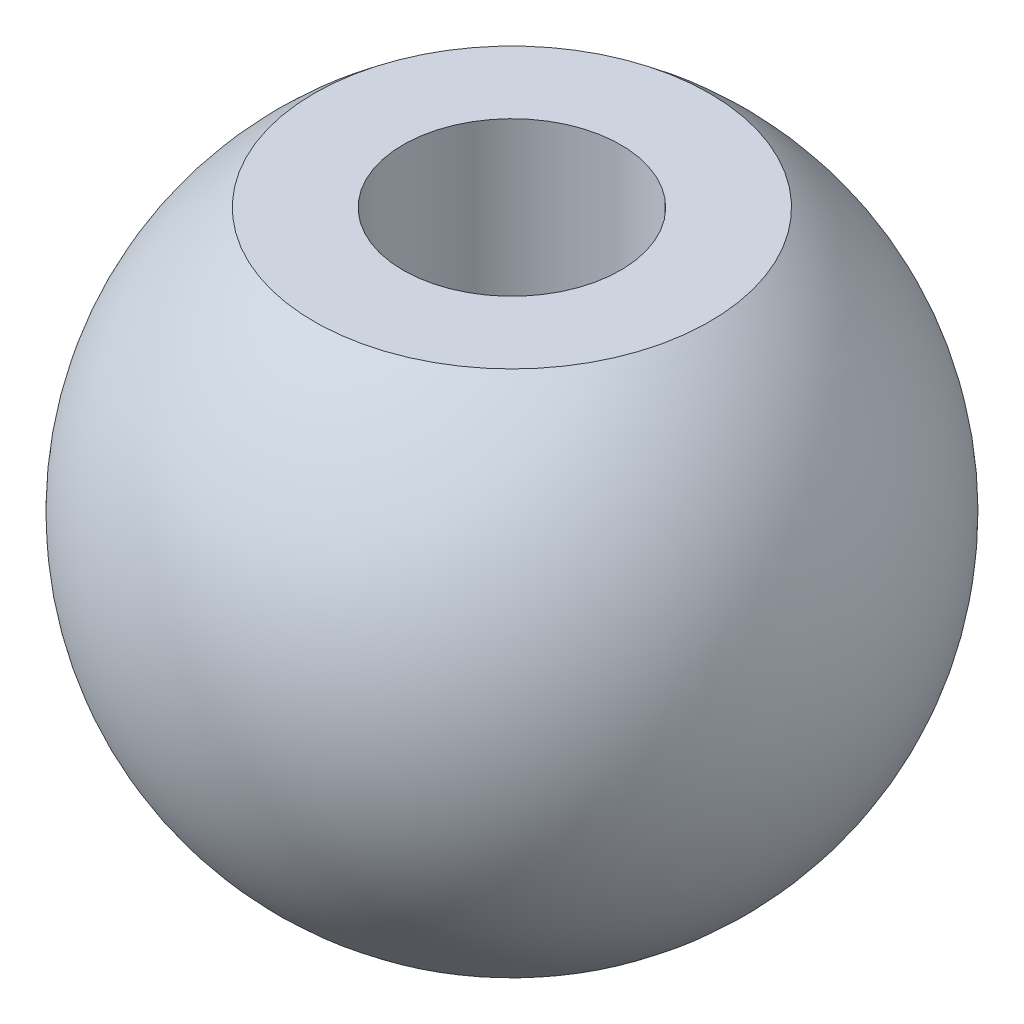
ISO-10303-21;
HEADER;
FILE_DESCRIPTION(('STEP AP214'),'2;1');
FILE_NAME('part.step','',(''),(''),'','','');
FILE_SCHEMA(('AUTOMOTIVE_DESIGN { 1 0 10303 214 1 1 1 1 }'));
ENDSEC;
DATA;
#1=APPLICATION_CONTEXT('core data for automotive mechanical design processes');
#2=APPLICATION_PROTOCOL_DEFINITION('international standard','automotive_design',2000,#1);
#3=PRODUCT_CONTEXT('',#1,'mechanical');
#4=PRODUCT('Part','Part','',(#3));
#5=PRODUCT_RELATED_PRODUCT_CATEGORY('part','',(#4));
#6=PRODUCT_DEFINITION_FORMATION('','',#4);
#7=PRODUCT_DEFINITION_CONTEXT('part definition',#1,'design');
#8=PRODUCT_DEFINITION('design','',#6,#7);
#9=PRODUCT_DEFINITION_SHAPE('','',#8);
#10=(LENGTH_UNIT() NAMED_UNIT(*) SI_UNIT(.MILLI.,.METRE.));
#11=(NAMED_UNIT(*) PLANE_ANGLE_UNIT() SI_UNIT($,.RADIAN.));
#12=(NAMED_UNIT(*) SI_UNIT($,.STERADIAN.) SOLID_ANGLE_UNIT());
#13=UNCERTAINTY_MEASURE_WITH_UNIT(LENGTH_MEASURE(1.E-05),#10,'distance_accuracy_value','');
#14=(GEOMETRIC_REPRESENTATION_CONTEXT(3) GLOBAL_UNCERTAINTY_ASSIGNED_CONTEXT((#13)) GLOBAL_UNIT_ASSIGNED_CONTEXT((#10,
#11,#12)) REPRESENTATION_CONTEXT('',''));
#15=CARTESIAN_POINT('',(0.,0.,0.));
#16=DIRECTION('',(0.,0.,1.));
#17=DIRECTION('',(1.,0.,0.));
#18=AXIS2_PLACEMENT_3D('',#15,#16,#17);
#19=CARTESIAN_POINT('',(0.,5.,0.));
#20=DIRECTION('',(0.,-1.,0.));
#21=DIRECTION('',(-1.,0.,0.));
#22=AXIS2_PLACEMENT_3D('',#19,#20,#21);
#23=SPHERICAL_SURFACE('',#22,5.);
#24=CARTESIAN_POINT('',(0.,9.,0.));
#25=DIRECTION('',(0.,-1.,0.));
#26=DIRECTION('',(0.,0.,-1.));
#27=AXIS2_PLACEMENT_3D('',#24,#25,#26);
#28=CIRCLE('',#27,3.);
#29=CARTESIAN_POINT('',(0.,9.,-3.));
#30=VERTEX_POINT('',#29);
#31=EDGE_CURVE('E11',#30,#30,#28,.T.);
#32=ORIENTED_EDGE('',*,*,#31,.T.);
#33=EDGE_LOOP('',(#32));
#34=FACE_BOUND('',#33,.T.);
#35=ADVANCED_FACE('F36',(#34),#23,.T.);
#36=CARTESIAN_POINT('',(0.,9.,0.));
#37=DIRECTION('',(0.,1.,0.));
#38=DIRECTION('',(0.,0.,1.));
#39=AXIS2_PLACEMENT_3D('',#36,#37,#38);
#40=PLANE('',#39);
#41=CARTESIAN_POINT('',(0.,9.,0.));
#42=DIRECTION('',(0.,1.,0.));
#43=DIRECTION('',(0.,0.,1.));
#44=AXIS2_PLACEMENT_3D('',#41,#42,#43);
#45=CIRCLE('',#44,1.64999999999999);
#46=CARTESIAN_POINT('',(0.,9.,1.64999999999999));
#47=VERTEX_POINT('',#46);
#48=EDGE_CURVE('E54',#47,#47,#45,.T.);
#49=ORIENTED_EDGE('',*,*,#48,.F.);
#50=EDGE_LOOP('',(#49));
#51=FACE_BOUND('',#50,.T.);
#52=ORIENTED_EDGE('',*,*,#31,.F.);
#53=EDGE_LOOP('',(#52));
#54=FACE_BOUND('',#53,.T.);
#55=ADVANCED_FACE('F49',(#51,#54),#40,.T.);
#56=CARTESIAN_POINT('',(0.,3.,0.));
#57=DIRECTION('',(0.,1.,0.));
#58=DIRECTION('',(0.,0.,1.));
#59=AXIS2_PLACEMENT_3D('',#56,#57,#58);
#60=CONICAL_SURFACE('',#59,1.65,1.02974425867665);
#61=CARTESIAN_POINT('',(0.,2.00857997860453,0.));
#62=VERTEX_POINT('',#61);
#63=VERTEX_LOOP('',#62);
#64=FACE_BOUND('',#63,.T.);
#65=CARTESIAN_POINT('',(0.,3.,0.));
#66=DIRECTION('',(0.,1.,0.));
#67=DIRECTION('',(0.,0.,1.));
#68=AXIS2_PLACEMENT_3D('',#65,#66,#67);
#69=CIRCLE('',#68,1.65);
#70=CARTESIAN_POINT('',(0.,3.,1.65));
#71=VERTEX_POINT('',#70);
#72=EDGE_CURVE('E42',#71,#71,#69,.T.);
#73=ORIENTED_EDGE('',*,*,#72,.T.);
#74=EDGE_LOOP('',(#73));
#75=FACE_BOUND('',#74,.T.);
#76=ADVANCED_FACE('F45',(#64,#75),#60,.F.);
#77=CARTESIAN_POINT('',(0.,9.,0.));
#78=DIRECTION('',(0.,1.,0.));
#79=DIRECTION('',(0.,0.,1.));
#80=AXIS2_PLACEMENT_3D('',#77,#78,#79);
#81=CYLINDRICAL_SURFACE('',#80,1.64999999999999);
#82=ORIENTED_EDGE('',*,*,#72,.F.);
#83=EDGE_LOOP('',(#82));
#84=FACE_BOUND('',#83,.T.);
#85=ORIENTED_EDGE('',*,*,#48,.T.);
#86=EDGE_LOOP('',(#85));
#87=FACE_BOUND('',#86,.T.);
#88=ADVANCED_FACE('F48',(#84,#87),#81,.F.);
#89=CLOSED_SHELL('',(#35,#55,#76,#88));
#90=MANIFOLD_SOLID_BREP('B2',#89);
#91=ADVANCED_BREP_SHAPE_REPRESENTATION('',(#18,#90),#14);
#92=SHAPE_DEFINITION_REPRESENTATION(#9,#91);
ENDSEC;
END-ISO-10303-21;
